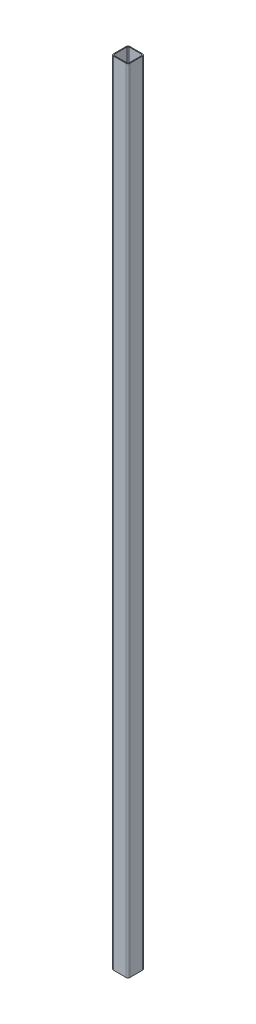
ISO-10303-21;
HEADER;
FILE_DESCRIPTION(('STEP AP214'),'2;1');
FILE_NAME('part.step','',(''),(''),'','','');
FILE_SCHEMA(('AUTOMOTIVE_DESIGN { 1 0 10303 214 1 1 1 1 }'));
ENDSEC;
DATA;
#1=APPLICATION_CONTEXT('core data for automotive mechanical design processes');
#2=APPLICATION_PROTOCOL_DEFINITION('international standard','automotive_design',2000,#1);
#3=PRODUCT_CONTEXT('',#1,'mechanical');
#4=PRODUCT('Part','Part','',(#3));
#5=PRODUCT_RELATED_PRODUCT_CATEGORY('part','',(#4));
#6=PRODUCT_DEFINITION_FORMATION('','',#4);
#7=PRODUCT_DEFINITION_CONTEXT('part definition',#1,'design');
#8=PRODUCT_DEFINITION('design','',#6,#7);
#9=PRODUCT_DEFINITION_SHAPE('','',#8);
#10=(LENGTH_UNIT() NAMED_UNIT(*) SI_UNIT(.MILLI.,.METRE.));
#11=(NAMED_UNIT(*) PLANE_ANGLE_UNIT() SI_UNIT($,.RADIAN.));
#12=(NAMED_UNIT(*) SI_UNIT($,.STERADIAN.) SOLID_ANGLE_UNIT());
#13=UNCERTAINTY_MEASURE_WITH_UNIT(LENGTH_MEASURE(1.E-05),#10,'distance_accuracy_value','');
#14=(GEOMETRIC_REPRESENTATION_CONTEXT(3) GLOBAL_UNCERTAINTY_ASSIGNED_CONTEXT((#13)) GLOBAL_UNIT_ASSIGNED_CONTEXT((#10,
#11,#12)) REPRESENTATION_CONTEXT('',''));
#15=CARTESIAN_POINT('',(0.,0.,0.));
#16=DIRECTION('',(0.,0.,1.));
#17=DIRECTION('',(1.,0.,0.));
#18=AXIS2_PLACEMENT_3D('',#15,#16,#17);
#19=CARTESIAN_POINT('',(15.5,0.,-2144.5));
#20=DIRECTION('',(0.,1.,0.));
#21=DIRECTION('',(0.,0.,1.));
#22=AXIS2_PLACEMENT_3D('',#19,#20,#21);
#23=CYLINDRICAL_SURFACE('',#22,4.5);
#24=CARTESIAN_POINT('',(15.5,1940.,-2144.5));
#25=DIRECTION('',(0.,1.,0.));
#26=DIRECTION('',(0.,0.,1.));
#27=AXIS2_PLACEMENT_3D('',#24,#25,#26);
#28=CIRCLE('',#27,4.5);
#29=CARTESIAN_POINT('',(15.5,1940.,-2140.));
#30=VERTEX_POINT('',#29);
#31=CARTESIAN_POINT('',(20.,1940.,-2144.5));
#32=VERTEX_POINT('',#31);
#33=EDGE_CURVE('E158',#30,#32,#28,.T.);
#34=ORIENTED_EDGE('',*,*,#33,.F.);
#35=DIRECTION('',(0.,1.,0.));
#36=VECTOR('',#35,1.);
#37=CARTESIAN_POINT('',(15.5,0.,-2140.));
#38=LINE('',#37,#36);
#39=CARTESIAN_POINT('',(15.5,20.,-2140.));
#40=VERTEX_POINT('',#39);
#41=EDGE_CURVE('E200',#40,#30,#38,.T.);
#42=ORIENTED_EDGE('',*,*,#41,.F.);
#43=CARTESIAN_POINT('',(15.5,20.,-2144.5));
#44=DIRECTION('',(0.,-1.,0.));
#45=DIRECTION('',(0.,0.,-1.));
#46=AXIS2_PLACEMENT_3D('',#43,#44,#45);
#47=CIRCLE('',#46,4.5);
#48=CARTESIAN_POINT('',(20.,20.,-2144.5));
#49=VERTEX_POINT('',#48);
#50=EDGE_CURVE('E250',#49,#40,#47,.T.);
#51=ORIENTED_EDGE('',*,*,#50,.F.);
#52=DIRECTION('',(0.,1.,0.));
#53=VECTOR('',#52,1.);
#54=CARTESIAN_POINT('',(20.,0.,-2144.5));
#55=LINE('',#54,#53);
#56=EDGE_CURVE('E203',#49,#32,#55,.T.);
#57=ORIENTED_EDGE('',*,*,#56,.T.);
#58=EDGE_LOOP('',(#34,#42,#51,#57));
#59=FACE_BOUND('',#58,.T.);
#60=ADVANCED_FACE('F39',(#59),#23,.T.);
#61=CARTESIAN_POINT('',(-15.5,0.,-2140.));
#62=DIRECTION('',(0.,0.,-1.));
#63=DIRECTION('',(-1.,0.,0.));
#64=AXIS2_PLACEMENT_3D('',#61,#62,#63);
#65=PLANE('',#64);
#66=DIRECTION('',(1.,0.,0.));
#67=VECTOR('',#66,1.);
#68=CARTESIAN_POINT('',(-15.5,1940.,-2140.));
#69=LINE('',#68,#67);
#70=CARTESIAN_POINT('',(-15.5,1940.,-2140.));
#71=VERTEX_POINT('',#70);
#72=EDGE_CURVE('E300',#71,#30,#69,.T.);
#73=ORIENTED_EDGE('',*,*,#72,.F.);
#74=DIRECTION('',(0.,1.,0.));
#75=VECTOR('',#74,1.);
#76=CARTESIAN_POINT('',(-15.5,0.,-2140.));
#77=LINE('',#76,#75);
#78=CARTESIAN_POINT('',(-15.5,20.,-2140.));
#79=VERTEX_POINT('',#78);
#80=EDGE_CURVE('E197',#79,#71,#77,.T.);
#81=ORIENTED_EDGE('',*,*,#80,.F.);
#82=DIRECTION('',(-1.,0.,0.));
#83=VECTOR('',#82,1.);
#84=CARTESIAN_POINT('',(-15.5,20.,-2140.));
#85=LINE('',#84,#83);
#86=EDGE_CURVE('E248',#40,#79,#85,.T.);
#87=ORIENTED_EDGE('',*,*,#86,.F.);
#88=ORIENTED_EDGE('',*,*,#41,.T.);
#89=EDGE_LOOP('',(#73,#81,#87,#88));
#90=FACE_BOUND('',#89,.T.);
#91=ADVANCED_FACE('F317',(#90),#65,.F.);
#92=CARTESIAN_POINT('',(-15.5,0.,-2144.5));
#93=DIRECTION('',(0.,1.,0.));
#94=DIRECTION('',(0.,0.,1.));
#95=AXIS2_PLACEMENT_3D('',#92,#93,#94);
#96=CYLINDRICAL_SURFACE('',#95,4.5);
#97=CARTESIAN_POINT('',(-15.5,1940.,-2144.5));
#98=DIRECTION('',(0.,1.,0.));
#99=DIRECTION('',(0.,0.,1.));
#100=AXIS2_PLACEMENT_3D('',#97,#98,#99);
#101=CIRCLE('',#100,4.5);
#102=CARTESIAN_POINT('',(-20.,1940.,-2144.5));
#103=VERTEX_POINT('',#102);
#104=EDGE_CURVE('E298',#103,#71,#101,.T.);
#105=ORIENTED_EDGE('',*,*,#104,.F.);
#106=DIRECTION('',(0.,1.,0.));
#107=VECTOR('',#106,1.);
#108=CARTESIAN_POINT('',(-20.,0.,-2144.5));
#109=LINE('',#108,#107);
#110=CARTESIAN_POINT('',(-20.,20.,-2144.5));
#111=VERTEX_POINT('',#110);
#112=EDGE_CURVE('E167',#111,#103,#109,.T.);
#113=ORIENTED_EDGE('',*,*,#112,.F.);
#114=CARTESIAN_POINT('',(-15.5,20.,-2144.5));
#115=DIRECTION('',(0.,-1.,0.));
#116=DIRECTION('',(0.,0.,-1.));
#117=AXIS2_PLACEMENT_3D('',#114,#115,#116);
#118=CIRCLE('',#117,4.5);
#119=EDGE_CURVE('E252',#79,#111,#118,.T.);
#120=ORIENTED_EDGE('',*,*,#119,.F.);
#121=ORIENTED_EDGE('',*,*,#80,.T.);
#122=EDGE_LOOP('',(#105,#113,#120,#121));
#123=FACE_BOUND('',#122,.T.);
#124=ADVANCED_FACE('F41',(#123),#96,.T.);
#125=CARTESIAN_POINT('',(-18.,0.,-2145.));
#126=DIRECTION('',(1.,0.,0.));
#127=DIRECTION('',(0.,0.,-1.));
#128=AXIS2_PLACEMENT_3D('',#125,#126,#127);
#129=PLANE('',#128);
#130=DIRECTION('',(0.,1.,0.));
#131=VECTOR('',#130,1.);
#132=CARTESIAN_POINT('',(-18.,0.,-2175.));
#133=LINE('',#132,#131);
#134=CARTESIAN_POINT('',(-18.,20.,-2175.));
#135=VERTEX_POINT('',#134);
#136=CARTESIAN_POINT('',(-18.,1940.,-2175.));
#137=VERTEX_POINT('',#136);
#138=EDGE_CURVE('E260',#135,#137,#133,.T.);
#139=ORIENTED_EDGE('',*,*,#138,.T.);
#140=DIRECTION('',(0.,0.,1.));
#141=VECTOR('',#140,1.);
#142=CARTESIAN_POINT('',(-18.,1940.,-2145.));
#143=LINE('',#142,#141);
#144=CARTESIAN_POINT('',(-18.,1940.,-2145.));
#145=VERTEX_POINT('',#144);
#146=EDGE_CURVE('E295',#137,#145,#143,.T.);
#147=ORIENTED_EDGE('',*,*,#146,.T.);
#148=DIRECTION('',(0.,1.,0.));
#149=VECTOR('',#148,1.);
#150=CARTESIAN_POINT('',(-18.,0.,-2145.));
#151=LINE('',#150,#149);
#152=CARTESIAN_POINT('',(-18.,20.,-2145.));
#153=VERTEX_POINT('',#152);
#154=EDGE_CURVE('E175',#153,#145,#151,.T.);
#155=ORIENTED_EDGE('',*,*,#154,.F.);
#156=DIRECTION('',(0.,0.,-1.));
#157=VECTOR('',#156,1.);
#158=CARTESIAN_POINT('',(-18.,20.,-2145.));
#159=LINE('',#158,#157);
#160=EDGE_CURVE('E47',#153,#135,#159,.T.);
#161=ORIENTED_EDGE('',*,*,#160,.T.);
#162=EDGE_LOOP('',(#139,#147,#155,#161));
#163=FACE_BOUND('',#162,.T.);
#164=ADVANCED_FACE('F320',(#163),#129,.T.);
#165=CARTESIAN_POINT('',(-15.,0.,-2145.));
#166=DIRECTION('',(0.,1.,0.));
#167=DIRECTION('',(0.,0.,1.));
#168=AXIS2_PLACEMENT_3D('',#165,#166,#167);
#169=CYLINDRICAL_SURFACE('',#168,3.);
#170=ORIENTED_EDGE('',*,*,#154,.T.);
#171=CARTESIAN_POINT('',(-15.,1940.,-2145.));
#172=DIRECTION('',(0.,1.,0.));
#173=DIRECTION('',(0.,0.,1.));
#174=AXIS2_PLACEMENT_3D('',#171,#172,#173);
#175=CIRCLE('',#174,3.);
#176=CARTESIAN_POINT('',(-15.,1940.,-2142.));
#177=VERTEX_POINT('',#176);
#178=EDGE_CURVE('E11',#145,#177,#175,.T.);
#179=ORIENTED_EDGE('',*,*,#178,.T.);
#180=DIRECTION('',(0.,1.,0.));
#181=VECTOR('',#180,1.);
#182=CARTESIAN_POINT('',(-15.,0.,-2142.));
#183=LINE('',#182,#181);
#184=CARTESIAN_POINT('',(-15.,20.,-2142.));
#185=VERTEX_POINT('',#184);
#186=EDGE_CURVE('E181',#185,#177,#183,.T.);
#187=ORIENTED_EDGE('',*,*,#186,.F.);
#188=CARTESIAN_POINT('',(-15.,20.,-2145.));
#189=DIRECTION('',(0.,-1.,0.));
#190=DIRECTION('',(0.,0.,-1.));
#191=AXIS2_PLACEMENT_3D('',#188,#189,#190);
#192=CIRCLE('',#191,3.);
#193=EDGE_CURVE('E245',#185,#153,#192,.T.);
#194=ORIENTED_EDGE('',*,*,#193,.T.);
#195=EDGE_LOOP('',(#170,#179,#187,#194));
#196=FACE_BOUND('',#195,.T.);
#197=ADVANCED_FACE('F326',(#196),#169,.F.);
#198=CARTESIAN_POINT('',(-15.,0.,-2142.));
#199=DIRECTION('',(0.,0.,-1.));
#200=DIRECTION('',(-1.,0.,0.));
#201=AXIS2_PLACEMENT_3D('',#198,#199,#200);
#202=PLANE('',#201);
#203=ORIENTED_EDGE('',*,*,#186,.T.);
#204=DIRECTION('',(1.,0.,0.));
#205=VECTOR('',#204,1.);
#206=CARTESIAN_POINT('',(-15.,1940.,-2142.));
#207=LINE('',#206,#205);
#208=CARTESIAN_POINT('',(15.,1940.,-2142.));
#209=VERTEX_POINT('',#208);
#210=EDGE_CURVE('E62',#177,#209,#207,.T.);
#211=ORIENTED_EDGE('',*,*,#210,.T.);
#212=DIRECTION('',(0.,1.,0.));
#213=VECTOR('',#212,1.);
#214=CARTESIAN_POINT('',(15.,0.,-2142.));
#215=LINE('',#214,#213);
#216=CARTESIAN_POINT('',(15.,20.,-2142.));
#217=VERTEX_POINT('',#216);
#218=EDGE_CURVE('E187',#217,#209,#215,.T.);
#219=ORIENTED_EDGE('',*,*,#218,.F.);
#220=DIRECTION('',(-1.,0.,0.));
#221=VECTOR('',#220,1.);
#222=CARTESIAN_POINT('',(-15.,20.,-2142.));
#223=LINE('',#222,#221);
#224=EDGE_CURVE('E243',#217,#185,#223,.T.);
#225=ORIENTED_EDGE('',*,*,#224,.T.);
#226=EDGE_LOOP('',(#203,#211,#219,#225));
#227=FACE_BOUND('',#226,.T.);
#228=ADVANCED_FACE('F368',(#227),#202,.T.);
#229=CARTESIAN_POINT('',(15.,0.,-2145.));
#230=DIRECTION('',(0.,1.,0.));
#231=DIRECTION('',(0.,0.,1.));
#232=AXIS2_PLACEMENT_3D('',#229,#230,#231);
#233=CYLINDRICAL_SURFACE('',#232,3.);
#234=ORIENTED_EDGE('',*,*,#218,.T.);
#235=CARTESIAN_POINT('',(15.,1940.,-2145.));
#236=DIRECTION('',(0.,1.,0.));
#237=DIRECTION('',(0.,0.,1.));
#238=AXIS2_PLACEMENT_3D('',#235,#236,#237);
#239=CIRCLE('',#238,3.);
#240=CARTESIAN_POINT('',(18.,1940.,-2145.));
#241=VERTEX_POINT('',#240);
#242=EDGE_CURVE('E281',#209,#241,#239,.T.);
#243=ORIENTED_EDGE('',*,*,#242,.T.);
#244=DIRECTION('',(0.,1.,0.));
#245=VECTOR('',#244,1.);
#246=CARTESIAN_POINT('',(18.,0.,-2145.));
#247=LINE('',#246,#245);
#248=CARTESIAN_POINT('',(18.,20.,-2145.));
#249=VERTEX_POINT('',#248);
#250=EDGE_CURVE('E193',#249,#241,#247,.T.);
#251=ORIENTED_EDGE('',*,*,#250,.F.);
#252=CARTESIAN_POINT('',(15.,20.,-2145.));
#253=DIRECTION('',(0.,-1.,0.));
#254=DIRECTION('',(0.,0.,-1.));
#255=AXIS2_PLACEMENT_3D('',#252,#253,#254);
#256=CIRCLE('',#255,3.);
#257=EDGE_CURVE('E240',#249,#217,#256,.T.);
#258=ORIENTED_EDGE('',*,*,#257,.T.);
#259=EDGE_LOOP('',(#234,#243,#251,#258));
#260=FACE_BOUND('',#259,.T.);
#261=ADVANCED_FACE('F279',(#260),#233,.F.);
#262=CARTESIAN_POINT('',(18.,0.,-2145.));
#263=DIRECTION('',(-1.,0.,0.));
#264=DIRECTION('',(0.,0.,1.));
#265=AXIS2_PLACEMENT_3D('',#262,#263,#264);
#266=PLANE('',#265);
#267=ORIENTED_EDGE('',*,*,#250,.T.);
#268=DIRECTION('',(0.,0.,-1.));
#269=VECTOR('',#268,1.);
#270=CARTESIAN_POINT('',(18.,1940.,-2145.));
#271=LINE('',#270,#269);
#272=CARTESIAN_POINT('',(18.,1940.,-2175.));
#273=VERTEX_POINT('',#272);
#274=EDGE_CURVE('E276',#241,#273,#271,.T.);
#275=ORIENTED_EDGE('',*,*,#274,.T.);
#276=DIRECTION('',(0.,1.,0.));
#277=VECTOR('',#276,1.);
#278=CARTESIAN_POINT('',(18.,0.,-2175.));
#279=LINE('',#278,#277);
#280=CARTESIAN_POINT('',(18.,20.,-2175.));
#281=VERTEX_POINT('',#280);
#282=EDGE_CURVE('E268',#281,#273,#279,.T.);
#283=ORIENTED_EDGE('',*,*,#282,.F.);
#284=DIRECTION('',(0.,0.,1.));
#285=VECTOR('',#284,1.);
#286=CARTESIAN_POINT('',(18.,20.,-2145.));
#287=LINE('',#286,#285);
#288=EDGE_CURVE('E237',#281,#249,#287,.T.);
#289=ORIENTED_EDGE('',*,*,#288,.T.);
#290=EDGE_LOOP('',(#267,#275,#283,#289));
#291=FACE_BOUND('',#290,.T.);
#292=ADVANCED_FACE('F274',(#291),#266,.T.);
#293=CARTESIAN_POINT('',(15.,0.,-2175.));
#294=DIRECTION('',(0.,1.,0.));
#295=DIRECTION('',(0.,0.,1.));
#296=AXIS2_PLACEMENT_3D('',#293,#294,#295);
#297=CYLINDRICAL_SURFACE('',#296,3.);
#298=ORIENTED_EDGE('',*,*,#282,.T.);
#299=CARTESIAN_POINT('',(15.,1940.,-2175.));
#300=DIRECTION('',(0.,1.,0.));
#301=DIRECTION('',(0.,0.,1.));
#302=AXIS2_PLACEMENT_3D('',#299,#300,#301);
#303=CIRCLE('',#302,3.);
#304=CARTESIAN_POINT('',(15.,1940.,-2178.));
#305=VERTEX_POINT('',#304);
#306=EDGE_CURVE('E283',#273,#305,#303,.T.);
#307=ORIENTED_EDGE('',*,*,#306,.T.);
#308=DIRECTION('',(0.,1.,0.));
#309=VECTOR('',#308,1.);
#310=CARTESIAN_POINT('',(15.,0.,-2178.));
#311=LINE('',#310,#309);
#312=CARTESIAN_POINT('',(15.,20.,-2178.));
#313=VERTEX_POINT('',#312);
#314=EDGE_CURVE('E265',#313,#305,#311,.T.);
#315=ORIENTED_EDGE('',*,*,#314,.F.);
#316=CARTESIAN_POINT('',(15.,20.,-2175.));
#317=DIRECTION('',(0.,-1.,0.));
#318=DIRECTION('',(0.,0.,-1.));
#319=AXIS2_PLACEMENT_3D('',#316,#317,#318);
#320=CIRCLE('',#319,3.);
#321=EDGE_CURVE('E234',#313,#281,#320,.T.);
#322=ORIENTED_EDGE('',*,*,#321,.T.);
#323=EDGE_LOOP('',(#298,#307,#315,#322));
#324=FACE_BOUND('',#323,.T.);
#325=ADVANCED_FACE('F356',(#324),#297,.F.);
#326=CARTESIAN_POINT('',(-15.,0.,-2178.));
#327=DIRECTION('',(0.,0.,1.));
#328=DIRECTION('',(1.,0.,0.));
#329=AXIS2_PLACEMENT_3D('',#326,#327,#328);
#330=PLANE('',#329);
#331=ORIENTED_EDGE('',*,*,#314,.T.);
#332=DIRECTION('',(-1.,0.,0.));
#333=VECTOR('',#332,1.);
#334=CARTESIAN_POINT('',(-15.,1940.,-2178.));
#335=LINE('',#334,#333);
#336=CARTESIAN_POINT('',(-15.,1940.,-2178.));
#337=VERTEX_POINT('',#336);
#338=EDGE_CURVE('E289',#305,#337,#335,.T.);
#339=ORIENTED_EDGE('',*,*,#338,.T.);
#340=DIRECTION('',(0.,1.,0.));
#341=VECTOR('',#340,1.);
#342=CARTESIAN_POINT('',(-15.,0.,-2178.));
#343=LINE('',#342,#341);
#344=CARTESIAN_POINT('',(-15.,20.,-2178.));
#345=VERTEX_POINT('',#344);
#346=EDGE_CURVE('E262',#345,#337,#343,.T.);
#347=ORIENTED_EDGE('',*,*,#346,.F.);
#348=DIRECTION('',(1.,0.,0.));
#349=VECTOR('',#348,1.);
#350=CARTESIAN_POINT('',(-15.,20.,-2178.));
#351=LINE('',#350,#349);
#352=EDGE_CURVE('E231',#345,#313,#351,.T.);
#353=ORIENTED_EDGE('',*,*,#352,.T.);
#354=EDGE_LOOP('',(#331,#339,#347,#353));
#355=FACE_BOUND('',#354,.T.);
#356=ADVANCED_FACE('F349',(#355),#330,.T.);
#357=CARTESIAN_POINT('',(-15.,0.,-2175.));
#358=DIRECTION('',(0.,1.,0.));
#359=DIRECTION('',(0.,0.,1.));
#360=AXIS2_PLACEMENT_3D('',#357,#358,#359);
#361=CYLINDRICAL_SURFACE('',#360,3.);
#362=ORIENTED_EDGE('',*,*,#346,.T.);
#363=CARTESIAN_POINT('',(-15.,1940.,-2175.));
#364=DIRECTION('',(0.,1.,0.));
#365=DIRECTION('',(0.,0.,1.));
#366=AXIS2_PLACEMENT_3D('',#363,#364,#365);
#367=CIRCLE('',#366,3.);
#368=EDGE_CURVE('E292',#337,#137,#367,.T.);
#369=ORIENTED_EDGE('',*,*,#368,.T.);
#370=ORIENTED_EDGE('',*,*,#138,.F.);
#371=CARTESIAN_POINT('',(-15.,20.,-2175.));
#372=DIRECTION('',(0.,-1.,0.));
#373=DIRECTION('',(0.,0.,-1.));
#374=AXIS2_PLACEMENT_3D('',#371,#372,#373);
#375=CIRCLE('',#374,3.);
#376=EDGE_CURVE('E228',#135,#345,#375,.T.);
#377=ORIENTED_EDGE('',*,*,#376,.T.);
#378=EDGE_LOOP('',(#362,#369,#370,#377));
#379=FACE_BOUND('',#378,.T.);
#380=ADVANCED_FACE('F344',(#379),#361,.F.);
#381=CARTESIAN_POINT('',(-20.,0.,-2144.5));
#382=DIRECTION('',(1.,0.,0.));
#383=DIRECTION('',(0.,0.,-1.));
#384=AXIS2_PLACEMENT_3D('',#381,#382,#383);
#385=PLANE('',#384);
#386=DIRECTION('',(0.,0.,-1.));
#387=VECTOR('',#386,1.);
#388=CARTESIAN_POINT('',(-20.,1940.,0.));
#389=LINE('',#388,#387);
#390=CARTESIAN_POINT('',(-20.,1940.,-2175.5));
#391=VERTEX_POINT('',#390);
#392=EDGE_CURVE('E54',#103,#391,#389,.T.);
#393=ORIENTED_EDGE('',*,*,#392,.T.);
#394=DIRECTION('',(0.,1.,0.));
#395=VECTOR('',#394,1.);
#396=CARTESIAN_POINT('',(-20.,0.,-2175.5));
#397=LINE('',#396,#395);
#398=CARTESIAN_POINT('',(-20.,20.,-2175.5));
#399=VERTEX_POINT('',#398);
#400=EDGE_CURVE('E165',#399,#391,#397,.T.);
#401=ORIENTED_EDGE('',*,*,#400,.F.);
#402=DIRECTION('',(0.,0.,1.));
#403=VECTOR('',#402,1.);
#404=CARTESIAN_POINT('',(-20.,20.,-3240.));
#405=LINE('',#404,#403);
#406=EDGE_CURVE('E226',#399,#111,#405,.T.);
#407=ORIENTED_EDGE('',*,*,#406,.T.);
#408=ORIENTED_EDGE('',*,*,#112,.T.);
#409=EDGE_LOOP('',(#393,#401,#407,#408));
#410=FACE_BOUND('',#409,.T.);
#411=ADVANCED_FACE('F163',(#410),#385,.F.);
#412=CARTESIAN_POINT('',(-15.5,0.,-2180.));
#413=DIRECTION('',(0.,0.,1.));
#414=DIRECTION('',(1.,0.,0.));
#415=AXIS2_PLACEMENT_3D('',#412,#413,#414);
#416=PLANE('',#415);
#417=DIRECTION('',(-1.,0.,0.));
#418=VECTOR('',#417,1.);
#419=CARTESIAN_POINT('',(-15.5,1940.,-2180.));
#420=LINE('',#419,#418);
#421=CARTESIAN_POINT('',(15.5,1940.,-2180.));
#422=VERTEX_POINT('',#421);
#423=CARTESIAN_POINT('',(-15.5,1940.,-2180.));
#424=VERTEX_POINT('',#423);
#425=EDGE_CURVE('E154',#422,#424,#420,.T.);
#426=ORIENTED_EDGE('',*,*,#425,.F.);
#427=DIRECTION('',(0.,1.,0.));
#428=VECTOR('',#427,1.);
#429=CARTESIAN_POINT('',(15.5,0.,-2180.));
#430=LINE('',#429,#428);
#431=CARTESIAN_POINT('',(15.5,20.,-2180.));
#432=VERTEX_POINT('',#431);
#433=EDGE_CURVE('E177',#432,#422,#430,.T.);
#434=ORIENTED_EDGE('',*,*,#433,.F.);
#435=DIRECTION('',(1.,0.,0.));
#436=VECTOR('',#435,1.);
#437=CARTESIAN_POINT('',(-15.5,20.,-2180.));
#438=LINE('',#437,#436);
#439=CARTESIAN_POINT('',(-15.5,20.,-2180.));
#440=VERTEX_POINT('',#439);
#441=EDGE_CURVE('E255',#440,#432,#438,.T.);
#442=ORIENTED_EDGE('',*,*,#441,.F.);
#443=DIRECTION('',(0.,1.,0.));
#444=VECTOR('',#443,1.);
#445=CARTESIAN_POINT('',(-15.5,0.,-2180.));
#446=LINE('',#445,#444);
#447=EDGE_CURVE('E173',#440,#424,#446,.T.);
#448=ORIENTED_EDGE('',*,*,#447,.T.);
#449=EDGE_LOOP('',(#426,#434,#442,#448));
#450=FACE_BOUND('',#449,.T.);
#451=ADVANCED_FACE('F221',(#450),#416,.F.);
#452=CARTESIAN_POINT('',(-15.5,20.,-3240.));
#453=DIRECTION('',(0.,-1.,0.));
#454=DIRECTION('',(0.,0.,-1.));
#455=AXIS2_PLACEMENT_3D('',#452,#453,#454);
#456=PLANE('',#455);
#457=ORIENTED_EDGE('',*,*,#224,.F.);
#458=ORIENTED_EDGE('',*,*,#257,.F.);
#459=ORIENTED_EDGE('',*,*,#288,.F.);
#460=ORIENTED_EDGE('',*,*,#321,.F.);
#461=ORIENTED_EDGE('',*,*,#352,.F.);
#462=ORIENTED_EDGE('',*,*,#376,.F.);
#463=ORIENTED_EDGE('',*,*,#160,.F.);
#464=ORIENTED_EDGE('',*,*,#193,.F.);
#465=EDGE_LOOP('',(#457,#458,#459,#460,#461,#462,#463,#464));
#466=FACE_BOUND('',#465,.T.);
#467=CARTESIAN_POINT('',(-15.5,20.,-2175.5));
#468=DIRECTION('',(0.,-1.,0.));
#469=DIRECTION('',(0.,0.,-1.));
#470=AXIS2_PLACEMENT_3D('',#467,#468,#469);
#471=CIRCLE('',#470,4.5);
#472=EDGE_CURVE('E172',#399,#440,#471,.T.);
#473=ORIENTED_EDGE('',*,*,#472,.T.);
#474=ORIENTED_EDGE('',*,*,#441,.T.);
#475=CARTESIAN_POINT('',(15.5,20.,-2175.5));
#476=DIRECTION('',(0.,-1.,0.));
#477=DIRECTION('',(0.,0.,-1.));
#478=AXIS2_PLACEMENT_3D('',#475,#476,#477);
#479=CIRCLE('',#478,4.5);
#480=CARTESIAN_POINT('',(20.,20.,-2175.5));
#481=VERTEX_POINT('',#480);
#482=EDGE_CURVE('E215',#432,#481,#479,.T.);
#483=ORIENTED_EDGE('',*,*,#482,.T.);
#484=DIRECTION('',(0.,0.,1.));
#485=VECTOR('',#484,1.);
#486=CARTESIAN_POINT('',(20.,20.,-3240.));
#487=LINE('',#486,#485);
#488=EDGE_CURVE('E219',#481,#49,#487,.T.);
#489=ORIENTED_EDGE('',*,*,#488,.T.);
#490=ORIENTED_EDGE('',*,*,#50,.T.);
#491=ORIENTED_EDGE('',*,*,#86,.T.);
#492=ORIENTED_EDGE('',*,*,#119,.T.);
#493=ORIENTED_EDGE('',*,*,#406,.F.);
#494=EDGE_LOOP('',(#473,#474,#483,#489,#490,#491,#492,#493));
#495=FACE_BOUND('',#494,.T.);
#496=ADVANCED_FACE('F313',(#466,#495),#456,.T.);
#497=CARTESIAN_POINT('',(20.,0.,-2144.5));
#498=DIRECTION('',(-1.,0.,0.));
#499=DIRECTION('',(0.,0.,1.));
#500=AXIS2_PLACEMENT_3D('',#497,#498,#499);
#501=PLANE('',#500);
#502=DIRECTION('',(0.,0.,-1.));
#503=VECTOR('',#502,1.);
#504=CARTESIAN_POINT('',(20.,1940.,0.));
#505=LINE('',#504,#503);
#506=CARTESIAN_POINT('',(20.,1940.,-2175.5));
#507=VERTEX_POINT('',#506);
#508=EDGE_CURVE('E168',#32,#507,#505,.T.);
#509=ORIENTED_EDGE('',*,*,#508,.F.);
#510=ORIENTED_EDGE('',*,*,#56,.F.);
#511=ORIENTED_EDGE('',*,*,#488,.F.);
#512=DIRECTION('',(0.,1.,0.));
#513=VECTOR('',#512,1.);
#514=CARTESIAN_POINT('',(20.,0.,-2175.5));
#515=LINE('',#514,#513);
#516=EDGE_CURVE('E206',#481,#507,#515,.T.);
#517=ORIENTED_EDGE('',*,*,#516,.T.);
#518=EDGE_LOOP('',(#509,#510,#511,#517));
#519=FACE_BOUND('',#518,.T.);
#520=ADVANCED_FACE('F307',(#519),#501,.F.);
#521=CARTESIAN_POINT('',(-15.5,1940.,0.));
#522=DIRECTION('',(0.,1.,0.));
#523=DIRECTION('',(0.,0.,1.));
#524=AXIS2_PLACEMENT_3D('',#521,#522,#523);
#525=PLANE('',#524);
#526=ORIENTED_EDGE('',*,*,#368,.F.);
#527=ORIENTED_EDGE('',*,*,#338,.F.);
#528=ORIENTED_EDGE('',*,*,#306,.F.);
#529=ORIENTED_EDGE('',*,*,#274,.F.);
#530=ORIENTED_EDGE('',*,*,#242,.F.);
#531=ORIENTED_EDGE('',*,*,#210,.F.);
#532=ORIENTED_EDGE('',*,*,#178,.F.);
#533=ORIENTED_EDGE('',*,*,#146,.F.);
#534=EDGE_LOOP('',(#526,#527,#528,#529,#530,#531,#532,#533));
#535=FACE_BOUND('',#534,.T.);
#536=CARTESIAN_POINT('',(15.5,1940.,-2175.5));
#537=DIRECTION('',(0.,1.,0.));
#538=DIRECTION('',(0.,0.,1.));
#539=AXIS2_PLACEMENT_3D('',#536,#537,#538);
#540=CIRCLE('',#539,4.5);
#541=EDGE_CURVE('E214',#507,#422,#540,.T.);
#542=ORIENTED_EDGE('',*,*,#541,.T.);
#543=ORIENTED_EDGE('',*,*,#425,.T.);
#544=CARTESIAN_POINT('',(-15.5,1940.,-2175.5));
#545=DIRECTION('',(0.,1.,0.));
#546=DIRECTION('',(0.,0.,1.));
#547=AXIS2_PLACEMENT_3D('',#544,#545,#546);
#548=CIRCLE('',#547,4.5);
#549=EDGE_CURVE('E150',#424,#391,#548,.T.);
#550=ORIENTED_EDGE('',*,*,#549,.T.);
#551=ORIENTED_EDGE('',*,*,#392,.F.);
#552=ORIENTED_EDGE('',*,*,#104,.T.);
#553=ORIENTED_EDGE('',*,*,#72,.T.);
#554=ORIENTED_EDGE('',*,*,#33,.T.);
#555=ORIENTED_EDGE('',*,*,#508,.T.);
#556=EDGE_LOOP('',(#542,#543,#550,#551,#552,#553,#554,#555));
#557=FACE_BOUND('',#556,.T.);
#558=ADVANCED_FACE('F152',(#535,#557),#525,.T.);
#559=CARTESIAN_POINT('',(15.5,0.,-2175.5));
#560=DIRECTION('',(0.,1.,0.));
#561=DIRECTION('',(0.,0.,1.));
#562=AXIS2_PLACEMENT_3D('',#559,#560,#561);
#563=CYLINDRICAL_SURFACE('',#562,4.5);
#564=ORIENTED_EDGE('',*,*,#541,.F.);
#565=ORIENTED_EDGE('',*,*,#516,.F.);
#566=ORIENTED_EDGE('',*,*,#482,.F.);
#567=ORIENTED_EDGE('',*,*,#433,.T.);
#568=EDGE_LOOP('',(#564,#565,#566,#567));
#569=FACE_BOUND('',#568,.T.);
#570=ADVANCED_FACE('F212',(#569),#563,.T.);
#571=CARTESIAN_POINT('',(-15.5,0.,-2175.5));
#572=DIRECTION('',(0.,1.,0.));
#573=DIRECTION('',(0.,0.,1.));
#574=AXIS2_PLACEMENT_3D('',#571,#572,#573);
#575=CYLINDRICAL_SURFACE('',#574,4.5);
#576=ORIENTED_EDGE('',*,*,#549,.F.);
#577=ORIENTED_EDGE('',*,*,#447,.F.);
#578=ORIENTED_EDGE('',*,*,#472,.F.);
#579=ORIENTED_EDGE('',*,*,#400,.T.);
#580=EDGE_LOOP('',(#576,#577,#578,#579));
#581=FACE_BOUND('',#580,.T.);
#582=ADVANCED_FACE('F171',(#581),#575,.T.);
#583=CLOSED_SHELL('',(#60,#91,#124,#164,#197,#228,#261,#292,#325,#356,#380,#411,#451,#496,#520,
#558,#570,#582));
#584=MANIFOLD_SOLID_BREP('B2',#583);
#585=ADVANCED_BREP_SHAPE_REPRESENTATION('',(#18,#584),#14);
#586=SHAPE_DEFINITION_REPRESENTATION(#9,#585);
ENDSEC;
END-ISO-10303-21;
